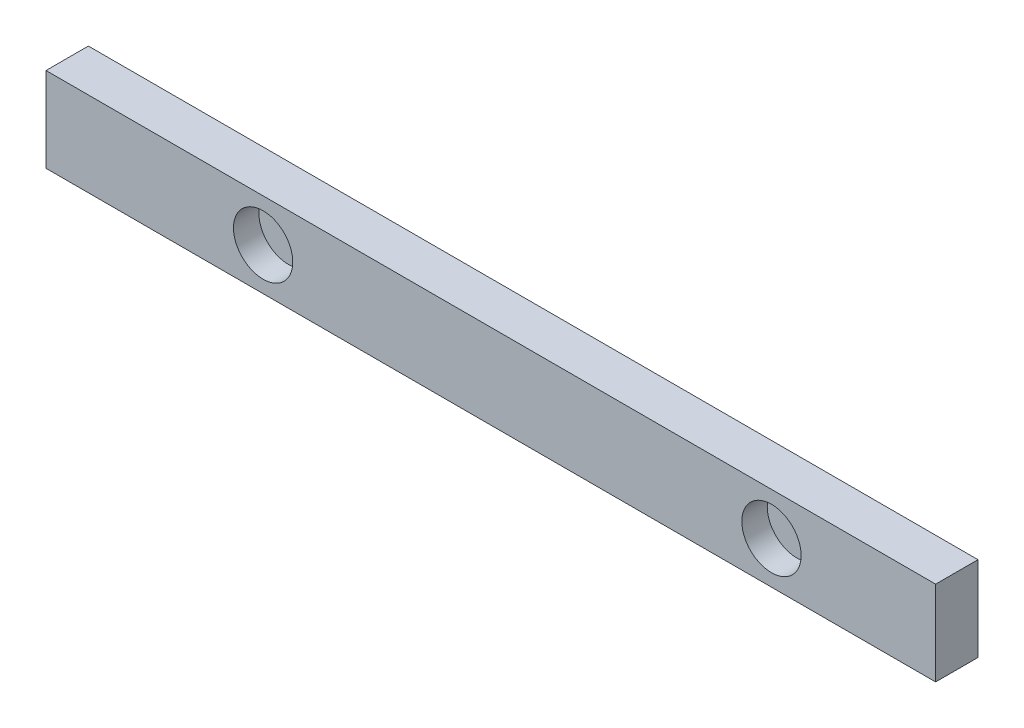
ISO-10303-21;
HEADER;
FILE_DESCRIPTION(('STEP AP214'),'2;1');
FILE_NAME('part.step','',(''),(''),'','','');
FILE_SCHEMA(('AUTOMOTIVE_DESIGN { 1 0 10303 214 1 1 1 1 }'));
ENDSEC;
DATA;
#1=APPLICATION_CONTEXT('core data for automotive mechanical design processes');
#2=APPLICATION_PROTOCOL_DEFINITION('international standard','automotive_design',2000,#1);
#3=PRODUCT_CONTEXT('',#1,'mechanical');
#4=PRODUCT('Part','Part','',(#3));
#5=PRODUCT_RELATED_PRODUCT_CATEGORY('part','',(#4));
#6=PRODUCT_DEFINITION_FORMATION('','',#4);
#7=PRODUCT_DEFINITION_CONTEXT('part definition',#1,'design');
#8=PRODUCT_DEFINITION('design','',#6,#7);
#9=PRODUCT_DEFINITION_SHAPE('','',#8);
#10=(LENGTH_UNIT() NAMED_UNIT(*) SI_UNIT(.MILLI.,.METRE.));
#11=(NAMED_UNIT(*) PLANE_ANGLE_UNIT() SI_UNIT($,.RADIAN.));
#12=(NAMED_UNIT(*) SI_UNIT($,.STERADIAN.) SOLID_ANGLE_UNIT());
#13=UNCERTAINTY_MEASURE_WITH_UNIT(LENGTH_MEASURE(1.E-05),#10,'distance_accuracy_value','');
#14=(GEOMETRIC_REPRESENTATION_CONTEXT(3) GLOBAL_UNCERTAINTY_ASSIGNED_CONTEXT((#13)) GLOBAL_UNIT_ASSIGNED_CONTEXT((#10,
#11,#12)) REPRESENTATION_CONTEXT('',''));
#15=CARTESIAN_POINT('',(0.,0.,0.));
#16=DIRECTION('',(0.,0.,1.));
#17=DIRECTION('',(1.,0.,0.));
#18=AXIS2_PLACEMENT_3D('',#15,#16,#17);
#19=CARTESIAN_POINT('',(0.,0.,25.4));
#20=DIRECTION('',(1.,0.,0.));
#21=DIRECTION('',(0.,0.,-1.));
#22=AXIS2_PLACEMENT_3D('',#19,#20,#21);
#23=PLANE('',#22);
#24=DIRECTION('',(0.,-1.,0.));
#25=VECTOR('',#24,1.);
#26=CARTESIAN_POINT('',(0.,0.,0.));
#27=LINE('',#26,#25);
#28=CARTESIAN_POINT('',(0.,50.8,0.));
#29=VERTEX_POINT('',#28);
#30=CARTESIAN_POINT('',(0.,0.,0.));
#31=VERTEX_POINT('',#30);
#32=EDGE_CURVE('E100',#29,#31,#27,.T.);
#33=ORIENTED_EDGE('',*,*,#32,.T.);
#34=DIRECTION('',(0.,0.,-1.));
#35=VECTOR('',#34,1.);
#36=CARTESIAN_POINT('',(0.,0.,25.4));
#37=LINE('',#36,#35);
#38=CARTESIAN_POINT('',(0.,0.,25.4));
#39=VERTEX_POINT('',#38);
#40=EDGE_CURVE('E11',#39,#31,#37,.T.);
#41=ORIENTED_EDGE('',*,*,#40,.F.);
#42=DIRECTION('',(0.,-1.,0.));
#43=VECTOR('',#42,1.);
#44=CARTESIAN_POINT('',(0.,0.,25.4));
#45=LINE('',#44,#43);
#46=CARTESIAN_POINT('',(0.,50.8,25.4));
#47=VERTEX_POINT('',#46);
#48=EDGE_CURVE('E87',#47,#39,#45,.T.);
#49=ORIENTED_EDGE('',*,*,#48,.F.);
#50=DIRECTION('',(0.,0.,-1.));
#51=VECTOR('',#50,1.);
#52=CARTESIAN_POINT('',(0.,50.8,25.4));
#53=LINE('',#52,#51);
#54=EDGE_CURVE('E96',#47,#29,#53,.T.);
#55=ORIENTED_EDGE('',*,*,#54,.T.);
#56=EDGE_LOOP('',(#33,#41,#49,#55));
#57=FACE_BOUND('',#56,.T.);
#58=ADVANCED_FACE('F34',(#57),#23,.F.);
#59=CARTESIAN_POINT('',(0.,0.,25.4));
#60=DIRECTION('',(0.,1.,0.));
#61=DIRECTION('',(0.,0.,1.));
#62=AXIS2_PLACEMENT_3D('',#59,#60,#61);
#63=PLANE('',#62);
#64=DIRECTION('',(1.,0.,0.));
#65=VECTOR('',#64,1.);
#66=CARTESIAN_POINT('',(0.,0.,0.));
#67=LINE('',#66,#65);
#68=CARTESIAN_POINT('',(533.4,0.,0.));
#69=VERTEX_POINT('',#68);
#70=EDGE_CURVE('E91',#31,#69,#67,.T.);
#71=ORIENTED_EDGE('',*,*,#70,.T.);
#72=DIRECTION('',(0.,0.,-1.));
#73=VECTOR('',#72,1.);
#74=CARTESIAN_POINT('',(533.4,0.,25.4));
#75=LINE('',#74,#73);
#76=CARTESIAN_POINT('',(533.4,0.,25.4));
#77=VERTEX_POINT('',#76);
#78=EDGE_CURVE('E43',#77,#69,#75,.T.);
#79=ORIENTED_EDGE('',*,*,#78,.F.);
#80=DIRECTION('',(1.,0.,0.));
#81=VECTOR('',#80,1.);
#82=CARTESIAN_POINT('',(0.,0.,25.4));
#83=LINE('',#82,#81);
#84=EDGE_CURVE('E82',#39,#77,#83,.T.);
#85=ORIENTED_EDGE('',*,*,#84,.F.);
#86=ORIENTED_EDGE('',*,*,#40,.T.);
#87=EDGE_LOOP('',(#71,#79,#85,#86));
#88=FACE_BOUND('',#87,.T.);
#89=ADVANCED_FACE('F90',(#88),#63,.F.);
#90=CARTESIAN_POINT('',(533.4,0.,25.4));
#91=DIRECTION('',(-1.,0.,0.));
#92=DIRECTION('',(0.,0.,1.));
#93=AXIS2_PLACEMENT_3D('',#90,#91,#92);
#94=PLANE('',#93);
#95=DIRECTION('',(0.,1.,0.));
#96=VECTOR('',#95,1.);
#97=CARTESIAN_POINT('',(533.4,0.,0.));
#98=LINE('',#97,#96);
#99=CARTESIAN_POINT('',(533.4,50.8,0.));
#100=VERTEX_POINT('',#99);
#101=EDGE_CURVE('E69',#69,#100,#98,.T.);
#102=ORIENTED_EDGE('',*,*,#101,.T.);
#103=DIRECTION('',(0.,0.,-1.));
#104=VECTOR('',#103,1.);
#105=CARTESIAN_POINT('',(533.4,50.8,25.4));
#106=LINE('',#105,#104);
#107=CARTESIAN_POINT('',(533.4,50.8,25.4));
#108=VERTEX_POINT('',#107);
#109=EDGE_CURVE('E92',#108,#100,#106,.T.);
#110=ORIENTED_EDGE('',*,*,#109,.F.);
#111=DIRECTION('',(0.,1.,0.));
#112=VECTOR('',#111,1.);
#113=CARTESIAN_POINT('',(533.4,0.,25.4));
#114=LINE('',#113,#112);
#115=EDGE_CURVE('E85',#77,#108,#114,.T.);
#116=ORIENTED_EDGE('',*,*,#115,.F.);
#117=ORIENTED_EDGE('',*,*,#78,.T.);
#118=EDGE_LOOP('',(#102,#110,#116,#117));
#119=FACE_BOUND('',#118,.T.);
#120=ADVANCED_FACE('F94',(#119),#94,.F.);
#121=CARTESIAN_POINT('',(0.,50.8,25.4));
#122=DIRECTION('',(0.,-1.,0.));
#123=DIRECTION('',(0.,0.,-1.));
#124=AXIS2_PLACEMENT_3D('',#121,#122,#123);
#125=PLANE('',#124);
#126=DIRECTION('',(-1.,0.,0.));
#127=VECTOR('',#126,1.);
#128=CARTESIAN_POINT('',(0.,50.8,0.));
#129=LINE('',#128,#127);
#130=EDGE_CURVE('E75',#100,#29,#129,.T.);
#131=ORIENTED_EDGE('',*,*,#130,.T.);
#132=ORIENTED_EDGE('',*,*,#54,.F.);
#133=DIRECTION('',(-1.,0.,0.));
#134=VECTOR('',#133,1.);
#135=CARTESIAN_POINT('',(0.,50.8,25.4));
#136=LINE('',#135,#134);
#137=EDGE_CURVE('E52',#108,#47,#136,.T.);
#138=ORIENTED_EDGE('',*,*,#137,.F.);
#139=ORIENTED_EDGE('',*,*,#109,.T.);
#140=EDGE_LOOP('',(#131,#132,#138,#139));
#141=FACE_BOUND('',#140,.T.);
#142=ADVANCED_FACE('F201',(#141),#125,.F.);
#143=CARTESIAN_POINT('',(0.,0.,25.4));
#144=DIRECTION('',(0.,0.,-1.));
#145=DIRECTION('',(-1.,0.,0.));
#146=AXIS2_PLACEMENT_3D('',#143,#144,#145);
#147=PLANE('',#146);
#148=CARTESIAN_POINT('',(130.175,25.2907213080391,25.4));
#149=DIRECTION('',(0.,0.,-1.));
#150=DIRECTION('',(-1.,0.,0.));
#151=AXIS2_PLACEMENT_3D('',#148,#149,#150);
#152=CIRCLE('',#151,17.78);
#153=CARTESIAN_POINT('',(112.395,25.2907213080391,25.4));
#154=VERTEX_POINT('',#153);
#155=EDGE_CURVE('E37',#154,#154,#152,.T.);
#156=ORIENTED_EDGE('',*,*,#155,.T.);
#157=EDGE_LOOP('',(#156));
#158=FACE_BOUND('',#157,.T.);
#159=CARTESIAN_POINT('',(434.975,25.2907213080391,25.4));
#160=DIRECTION('',(0.,0.,-1.));
#161=DIRECTION('',(-1.,0.,0.));
#162=AXIS2_PLACEMENT_3D('',#159,#160,#161);
#163=CIRCLE('',#162,17.78);
#164=CARTESIAN_POINT('',(417.195,25.2907213080391,25.4));
#165=VERTEX_POINT('',#164);
#166=EDGE_CURVE('E107',#165,#165,#163,.T.);
#167=ORIENTED_EDGE('',*,*,#166,.T.);
#168=EDGE_LOOP('',(#167));
#169=FACE_BOUND('',#168,.T.);
#170=ORIENTED_EDGE('',*,*,#48,.T.);
#171=ORIENTED_EDGE('',*,*,#84,.T.);
#172=ORIENTED_EDGE('',*,*,#115,.T.);
#173=ORIENTED_EDGE('',*,*,#137,.T.);
#174=EDGE_LOOP('',(#170,#171,#172,#173));
#175=FACE_BOUND('',#174,.T.);
#176=ADVANCED_FACE('F83',(#158,#169,#175),#147,.F.);
#177=CARTESIAN_POINT('',(0.,0.,0.));
#178=DIRECTION('',(0.,0.,-1.));
#179=DIRECTION('',(-1.,0.,0.));
#180=AXIS2_PLACEMENT_3D('',#177,#178,#179);
#181=PLANE('',#180);
#182=CARTESIAN_POINT('',(122.728486168932,18.9092553185146,0.));
#183=DIRECTION('',(0.,0.,-1.));
#184=DIRECTION('',(-1.,0.,0.));
#185=AXIS2_PLACEMENT_3D('',#182,#183,#184);
#186=CIRCLE('',#185,2.4638);
#187=CARTESIAN_POINT('',(120.264686168932,18.9092553185146,0.));
#188=VERTEX_POINT('',#187);
#189=EDGE_CURVE('E171',#188,#188,#186,.T.);
#190=ORIENTED_EDGE('',*,*,#189,.F.);
#191=EDGE_LOOP('',(#190));
#192=FACE_BOUND('',#191,.T.);
#193=CARTESIAN_POINT('',(122.728486168932,31.8907446814854,0.));
#194=DIRECTION('',(0.,0.,-1.));
#195=DIRECTION('',(-1.,0.,0.));
#196=AXIS2_PLACEMENT_3D('',#193,#194,#195);
#197=CIRCLE('',#196,2.4638);
#198=CARTESIAN_POINT('',(120.264686168932,31.8907446814854,0.));
#199=VERTEX_POINT('',#198);
#200=EDGE_CURVE('E165',#199,#199,#197,.T.);
#201=ORIENTED_EDGE('',*,*,#200,.F.);
#202=EDGE_LOOP('',(#201));
#203=FACE_BOUND('',#202,.T.);
#204=CARTESIAN_POINT('',(137.621513831068,18.9092553185146,0.));
#205=DIRECTION('',(0.,0.,-1.));
#206=DIRECTION('',(-1.,0.,0.));
#207=AXIS2_PLACEMENT_3D('',#204,#205,#206);
#208=CIRCLE('',#207,2.4638);
#209=CARTESIAN_POINT('',(135.157713831068,18.9092553185146,0.));
#210=VERTEX_POINT('',#209);
#211=EDGE_CURVE('E159',#210,#210,#208,.T.);
#212=ORIENTED_EDGE('',*,*,#211,.F.);
#213=EDGE_LOOP('',(#212));
#214=FACE_BOUND('',#213,.T.);
#215=CARTESIAN_POINT('',(137.621513831068,31.8907446814854,0.));
#216=DIRECTION('',(0.,0.,-1.));
#217=DIRECTION('',(-1.,0.,0.));
#218=AXIS2_PLACEMENT_3D('',#215,#216,#217);
#219=CIRCLE('',#218,2.4638);
#220=CARTESIAN_POINT('',(135.157713831068,31.8907446814854,0.));
#221=VERTEX_POINT('',#220);
#222=EDGE_CURVE('E135',#221,#221,#219,.T.);
#223=ORIENTED_EDGE('',*,*,#222,.F.);
#224=EDGE_LOOP('',(#223));
#225=FACE_BOUND('',#224,.T.);
#226=CARTESIAN_POINT('',(442.421513831068,18.9092553185146,0.));
#227=DIRECTION('',(0.,0.,-1.));
#228=DIRECTION('',(-1.,0.,0.));
#229=AXIS2_PLACEMENT_3D('',#226,#227,#228);
#230=CIRCLE('',#229,2.4638);
#231=CARTESIAN_POINT('',(439.957713831068,18.9092553185146,0.));
#232=VERTEX_POINT('',#231);
#233=EDGE_CURVE('E142',#232,#232,#230,.T.);
#234=ORIENTED_EDGE('',*,*,#233,.F.);
#235=EDGE_LOOP('',(#234));
#236=FACE_BOUND('',#235,.T.);
#237=CARTESIAN_POINT('',(427.528486168932,31.8907446814854,0.));
#238=DIRECTION('',(0.,0.,-1.));
#239=DIRECTION('',(-1.,0.,0.));
#240=AXIS2_PLACEMENT_3D('',#237,#238,#239);
#241=CIRCLE('',#240,2.4638);
#242=CARTESIAN_POINT('',(425.064686168932,31.8907446814854,0.));
#243=VERTEX_POINT('',#242);
#244=EDGE_CURVE('E149',#243,#243,#241,.T.);
#245=ORIENTED_EDGE('',*,*,#244,.F.);
#246=EDGE_LOOP('',(#245));
#247=FACE_BOUND('',#246,.T.);
#248=CARTESIAN_POINT('',(434.975,25.4,0.));
#249=DIRECTION('',(0.,0.,-1.));
#250=DIRECTION('',(-1.,0.,0.));
#251=AXIS2_PLACEMENT_3D('',#248,#249,#250);
#252=CIRCLE('',#251,6.01979999999996);
#253=CARTESIAN_POINT('',(428.9552,25.4,0.));
#254=VERTEX_POINT('',#253);
#255=EDGE_CURVE('E128',#254,#254,#252,.T.);
#256=ORIENTED_EDGE('',*,*,#255,.F.);
#257=EDGE_LOOP('',(#256));
#258=FACE_BOUND('',#257,.T.);
#259=CARTESIAN_POINT('',(427.528486168932,18.9092553185146,0.));
#260=DIRECTION('',(0.,0.,-1.));
#261=DIRECTION('',(-1.,0.,0.));
#262=AXIS2_PLACEMENT_3D('',#259,#260,#261);
#263=CIRCLE('',#262,2.4638);
#264=CARTESIAN_POINT('',(425.064686168932,18.9092553185146,0.));
#265=VERTEX_POINT('',#264);
#266=EDGE_CURVE('E136',#265,#265,#263,.T.);
#267=ORIENTED_EDGE('',*,*,#266,.F.);
#268=EDGE_LOOP('',(#267));
#269=FACE_BOUND('',#268,.T.);
#270=CARTESIAN_POINT('',(442.421513831068,31.8907446814854,0.));
#271=DIRECTION('',(0.,0.,-1.));
#272=DIRECTION('',(-1.,0.,0.));
#273=AXIS2_PLACEMENT_3D('',#270,#271,#272);
#274=CIRCLE('',#273,2.4638);
#275=CARTESIAN_POINT('',(439.957713831068,31.8907446814854,0.));
#276=VERTEX_POINT('',#275);
#277=EDGE_CURVE('E176',#276,#276,#274,.T.);
#278=ORIENTED_EDGE('',*,*,#277,.F.);
#279=EDGE_LOOP('',(#278));
#280=FACE_BOUND('',#279,.T.);
#281=CARTESIAN_POINT('',(130.175,25.4,0.));
#282=DIRECTION('',(0.,0.,-1.));
#283=DIRECTION('',(-1.,0.,0.));
#284=AXIS2_PLACEMENT_3D('',#281,#282,#283);
#285=CIRCLE('',#284,6.0198);
#286=CARTESIAN_POINT('',(124.1552,25.4,0.));
#287=VERTEX_POINT('',#286);
#288=EDGE_CURVE('E122',#287,#287,#285,.T.);
#289=ORIENTED_EDGE('',*,*,#288,.F.);
#290=EDGE_LOOP('',(#289));
#291=FACE_BOUND('',#290,.T.);
#292=ORIENTED_EDGE('',*,*,#32,.F.);
#293=ORIENTED_EDGE('',*,*,#130,.F.);
#294=ORIENTED_EDGE('',*,*,#101,.F.);
#295=ORIENTED_EDGE('',*,*,#70,.F.);
#296=EDGE_LOOP('',(#292,#293,#294,#295));
#297=FACE_BOUND('',#296,.T.);
#298=ADVANCED_FACE('F191',(#192,#203,#214,#225,#236,#247,#258,#269,#280,#291,#297),#181,.T.);
#299=CARTESIAN_POINT('',(434.975,25.2907213080391,137.16));
#300=DIRECTION('',(0.,0.,-1.));
#301=DIRECTION('',(-1.,0.,0.));
#302=AXIS2_PLACEMENT_3D('',#299,#300,#301);
#303=CYLINDRICAL_SURFACE('',#302,17.78);
#304=CARTESIAN_POINT('',(434.975,25.2907213080391,10.16));
#305=DIRECTION('',(0.,0.,-1.));
#306=DIRECTION('',(-1.,0.,0.));
#307=AXIS2_PLACEMENT_3D('',#304,#305,#306);
#308=CIRCLE('',#307,17.78);
#309=CARTESIAN_POINT('',(417.195,25.2907213080391,10.16));
#310=VERTEX_POINT('',#309);
#311=EDGE_CURVE('E114',#310,#310,#308,.T.);
#312=ORIENTED_EDGE('',*,*,#311,.T.);
#313=EDGE_LOOP('',(#312));
#314=FACE_BOUND('',#313,.T.);
#315=ORIENTED_EDGE('',*,*,#166,.F.);
#316=EDGE_LOOP('',(#315));
#317=FACE_BOUND('',#316,.T.);
#318=ADVANCED_FACE('F194',(#314,#317),#303,.F.);
#319=CARTESIAN_POINT('',(434.975,25.2907213080391,10.16));
#320=DIRECTION('',(0.,0.,-1.));
#321=DIRECTION('',(-1.,0.,0.));
#322=AXIS2_PLACEMENT_3D('',#319,#320,#321);
#323=PLANE('',#322);
#324=ORIENTED_EDGE('',*,*,#311,.F.);
#325=EDGE_LOOP('',(#324));
#326=FACE_BOUND('',#325,.T.);
#327=ADVANCED_FACE('F239',(#326),#323,.F.);
#328=CARTESIAN_POINT('',(130.175,25.2907213080391,137.16));
#329=DIRECTION('',(0.,0.,-1.));
#330=DIRECTION('',(-1.,0.,0.));
#331=AXIS2_PLACEMENT_3D('',#328,#329,#330);
#332=CYLINDRICAL_SURFACE('',#331,17.78);
#333=CARTESIAN_POINT('',(130.175,25.2907213080391,10.16));
#334=DIRECTION('',(0.,0.,-1.));
#335=DIRECTION('',(-1.,0.,0.));
#336=AXIS2_PLACEMENT_3D('',#333,#334,#335);
#337=CIRCLE('',#336,17.78);
#338=CARTESIAN_POINT('',(112.395,25.2907213080391,10.16));
#339=VERTEX_POINT('',#338);
#340=EDGE_CURVE('E109',#339,#339,#337,.T.);
#341=ORIENTED_EDGE('',*,*,#340,.T.);
#342=EDGE_LOOP('',(#341));
#343=FACE_BOUND('',#342,.T.);
#344=ORIENTED_EDGE('',*,*,#155,.F.);
#345=EDGE_LOOP('',(#344));
#346=FACE_BOUND('',#345,.T.);
#347=ADVANCED_FACE('F250',(#343,#346),#332,.F.);
#348=CARTESIAN_POINT('',(130.175,25.2907213080391,10.16));
#349=DIRECTION('',(0.,0.,-1.));
#350=DIRECTION('',(-1.,0.,0.));
#351=AXIS2_PLACEMENT_3D('',#348,#349,#350);
#352=PLANE('',#351);
#353=ORIENTED_EDGE('',*,*,#340,.F.);
#354=EDGE_LOOP('',(#353));
#355=FACE_BOUND('',#354,.T.);
#356=ADVANCED_FACE('F260',(#355),#352,.F.);
#357=CARTESIAN_POINT('',(130.175,25.4,7.62));
#358=DIRECTION('',(0.,0.,-1.));
#359=DIRECTION('',(-1.,0.,0.));
#360=AXIS2_PLACEMENT_3D('',#357,#358,#359);
#361=CYLINDRICAL_SURFACE('',#360,6.0198);
#362=CARTESIAN_POINT('',(130.175,25.4,7.62));
#363=DIRECTION('',(0.,0.,-1.));
#364=DIRECTION('',(-1.,0.,0.));
#365=AXIS2_PLACEMENT_3D('',#362,#363,#364);
#366=CIRCLE('',#365,6.0198);
#367=CARTESIAN_POINT('',(124.1552,25.4,7.62));
#368=VERTEX_POINT('',#367);
#369=EDGE_CURVE('E119',#368,#368,#366,.T.);
#370=ORIENTED_EDGE('',*,*,#369,.F.);
#371=EDGE_LOOP('',(#370));
#372=FACE_BOUND('',#371,.T.);
#373=ORIENTED_EDGE('',*,*,#288,.T.);
#374=EDGE_LOOP('',(#373));
#375=FACE_BOUND('',#374,.T.);
#376=ADVANCED_FACE('F268',(#372,#375),#361,.F.);
#377=CARTESIAN_POINT('',(130.175,25.4,7.62));
#378=DIRECTION('',(0.,0.,-1.));
#379=DIRECTION('',(-1.,0.,0.));
#380=AXIS2_PLACEMENT_3D('',#377,#378,#379);
#381=PLANE('',#380);
#382=ORIENTED_EDGE('',*,*,#369,.T.);
#383=EDGE_LOOP('',(#382));
#384=FACE_BOUND('',#383,.T.);
#385=ADVANCED_FACE('F187',(#384),#381,.T.);
#386=CARTESIAN_POINT('',(442.421513831068,31.8907446814854,7.62));
#387=DIRECTION('',(0.,0.,-1.));
#388=DIRECTION('',(-1.,0.,0.));
#389=AXIS2_PLACEMENT_3D('',#386,#387,#388);
#390=CYLINDRICAL_SURFACE('',#389,2.4638);
#391=CARTESIAN_POINT('',(442.421513831068,31.8907446814854,7.62));
#392=DIRECTION('',(0.,0.,-1.));
#393=DIRECTION('',(-1.,0.,0.));
#394=AXIS2_PLACEMENT_3D('',#391,#392,#393);
#395=CIRCLE('',#394,2.4638);
#396=CARTESIAN_POINT('',(439.957713831068,31.8907446814854,7.62));
#397=VERTEX_POINT('',#396);
#398=EDGE_CURVE('E146',#397,#397,#395,.T.);
#399=ORIENTED_EDGE('',*,*,#398,.F.);
#400=EDGE_LOOP('',(#399));
#401=FACE_BOUND('',#400,.T.);
#402=ORIENTED_EDGE('',*,*,#277,.T.);
#403=EDGE_LOOP('',(#402));
#404=FACE_BOUND('',#403,.T.);
#405=ADVANCED_FACE('F184',(#401,#404),#390,.F.);
#406=CARTESIAN_POINT('',(442.421513831068,31.8907446814854,7.62));
#407=DIRECTION('',(0.,0.,-1.));
#408=DIRECTION('',(-1.,0.,0.));
#409=AXIS2_PLACEMENT_3D('',#406,#407,#408);
#410=PLANE('',#409);
#411=ORIENTED_EDGE('',*,*,#398,.T.);
#412=EDGE_LOOP('',(#411));
#413=FACE_BOUND('',#412,.T.);
#414=ADVANCED_FACE('F182',(#413),#410,.T.);
#415=CARTESIAN_POINT('',(427.528486168932,18.9092553185146,7.62));
#416=DIRECTION('',(0.,0.,-1.));
#417=DIRECTION('',(-1.,0.,0.));
#418=AXIS2_PLACEMENT_3D('',#415,#416,#417);
#419=CYLINDRICAL_SURFACE('',#418,2.4638);
#420=CARTESIAN_POINT('',(427.528486168932,18.9092553185146,7.62));
#421=DIRECTION('',(0.,0.,-1.));
#422=DIRECTION('',(-1.,0.,0.));
#423=AXIS2_PLACEMENT_3D('',#420,#421,#422);
#424=CIRCLE('',#423,2.4638);
#425=CARTESIAN_POINT('',(425.064686168932,18.9092553185146,7.62));
#426=VERTEX_POINT('',#425);
#427=EDGE_CURVE('E132',#426,#426,#424,.T.);
#428=ORIENTED_EDGE('',*,*,#427,.F.);
#429=EDGE_LOOP('',(#428));
#430=FACE_BOUND('',#429,.T.);
#431=ORIENTED_EDGE('',*,*,#266,.T.);
#432=EDGE_LOOP('',(#431));
#433=FACE_BOUND('',#432,.T.);
#434=ADVANCED_FACE('F305',(#430,#433),#419,.F.);
#435=CARTESIAN_POINT('',(427.528486168932,18.9092553185146,7.62));
#436=DIRECTION('',(0.,0.,-1.));
#437=DIRECTION('',(-1.,0.,0.));
#438=AXIS2_PLACEMENT_3D('',#435,#436,#437);
#439=PLANE('',#438);
#440=ORIENTED_EDGE('',*,*,#427,.T.);
#441=EDGE_LOOP('',(#440));
#442=FACE_BOUND('',#441,.T.);
#443=ADVANCED_FACE('F314',(#442),#439,.T.);
#444=CARTESIAN_POINT('',(434.975,25.4,7.62));
#445=DIRECTION('',(0.,0.,-1.));
#446=DIRECTION('',(-1.,0.,0.));
#447=AXIS2_PLACEMENT_3D('',#444,#445,#446);
#448=CYLINDRICAL_SURFACE('',#447,6.01979999999996);
#449=CARTESIAN_POINT('',(434.975,25.4,7.62));
#450=DIRECTION('',(0.,0.,-1.));
#451=DIRECTION('',(-1.,0.,0.));
#452=AXIS2_PLACEMENT_3D('',#449,#450,#451);
#453=CIRCLE('',#452,6.01979999999996);
#454=CARTESIAN_POINT('',(428.9552,25.4,7.62));
#455=VERTEX_POINT('',#454);
#456=EDGE_CURVE('E131',#455,#455,#453,.T.);
#457=ORIENTED_EDGE('',*,*,#456,.F.);
#458=EDGE_LOOP('',(#457));
#459=FACE_BOUND('',#458,.T.);
#460=ORIENTED_EDGE('',*,*,#255,.T.);
#461=EDGE_LOOP('',(#460));
#462=FACE_BOUND('',#461,.T.);
#463=ADVANCED_FACE('F324',(#459,#462),#448,.F.);
#464=CARTESIAN_POINT('',(434.975,25.4,7.62));
#465=DIRECTION('',(0.,0.,-1.));
#466=DIRECTION('',(-1.,0.,0.));
#467=AXIS2_PLACEMENT_3D('',#464,#465,#466);
#468=PLANE('',#467);
#469=ORIENTED_EDGE('',*,*,#456,.T.);
#470=EDGE_LOOP('',(#469));
#471=FACE_BOUND('',#470,.T.);
#472=ADVANCED_FACE('F334',(#471),#468,.T.);
#473=CARTESIAN_POINT('',(427.528486168932,31.8907446814854,7.62));
#474=DIRECTION('',(0.,0.,-1.));
#475=DIRECTION('',(-1.,0.,0.));
#476=AXIS2_PLACEMENT_3D('',#473,#474,#475);
#477=CYLINDRICAL_SURFACE('',#476,2.4638);
#478=CARTESIAN_POINT('',(427.528486168932,31.8907446814854,7.62));
#479=DIRECTION('',(0.,0.,-1.));
#480=DIRECTION('',(-1.,0.,0.));
#481=AXIS2_PLACEMENT_3D('',#478,#479,#480);
#482=CIRCLE('',#481,2.4638);
#483=CARTESIAN_POINT('',(425.064686168932,31.8907446814854,7.62));
#484=VERTEX_POINT('',#483);
#485=EDGE_CURVE('E139',#484,#484,#482,.T.);
#486=ORIENTED_EDGE('',*,*,#485,.F.);
#487=EDGE_LOOP('',(#486));
#488=FACE_BOUND('',#487,.T.);
#489=ORIENTED_EDGE('',*,*,#244,.T.);
#490=EDGE_LOOP('',(#489));
#491=FACE_BOUND('',#490,.T.);
#492=ADVANCED_FACE('F344',(#488,#491),#477,.F.);
#493=CARTESIAN_POINT('',(427.528486168932,31.8907446814854,7.62));
#494=DIRECTION('',(0.,0.,-1.));
#495=DIRECTION('',(-1.,0.,0.));
#496=AXIS2_PLACEMENT_3D('',#493,#494,#495);
#497=PLANE('',#496);
#498=ORIENTED_EDGE('',*,*,#485,.T.);
#499=EDGE_LOOP('',(#498));
#500=FACE_BOUND('',#499,.T.);
#501=ADVANCED_FACE('F354',(#500),#497,.T.);
#502=CARTESIAN_POINT('',(442.421513831068,18.9092553185146,7.62));
#503=DIRECTION('',(0.,0.,-1.));
#504=DIRECTION('',(-1.,0.,0.));
#505=AXIS2_PLACEMENT_3D('',#502,#503,#504);
#506=CYLINDRICAL_SURFACE('',#505,2.4638);
#507=CARTESIAN_POINT('',(442.421513831068,18.9092553185146,7.62));
#508=DIRECTION('',(0.,0.,-1.));
#509=DIRECTION('',(-1.,0.,0.));
#510=AXIS2_PLACEMENT_3D('',#507,#508,#509);
#511=CIRCLE('',#510,2.4638);
#512=CARTESIAN_POINT('',(439.957713831068,18.9092553185146,7.62));
#513=VERTEX_POINT('',#512);
#514=EDGE_CURVE('E145',#513,#513,#511,.T.);
#515=ORIENTED_EDGE('',*,*,#514,.F.);
#516=EDGE_LOOP('',(#515));
#517=FACE_BOUND('',#516,.T.);
#518=ORIENTED_EDGE('',*,*,#233,.T.);
#519=EDGE_LOOP('',(#518));
#520=FACE_BOUND('',#519,.T.);
#521=ADVANCED_FACE('F364',(#517,#520),#506,.F.);
#522=CARTESIAN_POINT('',(442.421513831068,18.9092553185146,7.62));
#523=DIRECTION('',(0.,0.,-1.));
#524=DIRECTION('',(-1.,0.,0.));
#525=AXIS2_PLACEMENT_3D('',#522,#523,#524);
#526=PLANE('',#525);
#527=ORIENTED_EDGE('',*,*,#514,.T.);
#528=EDGE_LOOP('',(#527));
#529=FACE_BOUND('',#528,.T.);
#530=ADVANCED_FACE('F374',(#529),#526,.T.);
#531=CARTESIAN_POINT('',(137.621513831068,31.8907446814854,7.62));
#532=DIRECTION('',(0.,0.,-1.));
#533=DIRECTION('',(-1.,0.,0.));
#534=AXIS2_PLACEMENT_3D('',#531,#532,#533);
#535=CYLINDRICAL_SURFACE('',#534,2.4638);
#536=CARTESIAN_POINT('',(137.621513831068,31.8907446814854,7.62));
#537=DIRECTION('',(0.,0.,-1.));
#538=DIRECTION('',(-1.,0.,0.));
#539=AXIS2_PLACEMENT_3D('',#536,#537,#538);
#540=CIRCLE('',#539,2.4638);
#541=CARTESIAN_POINT('',(135.157713831068,31.8907446814854,7.62));
#542=VERTEX_POINT('',#541);
#543=EDGE_CURVE('E156',#542,#542,#540,.T.);
#544=ORIENTED_EDGE('',*,*,#543,.F.);
#545=EDGE_LOOP('',(#544));
#546=FACE_BOUND('',#545,.T.);
#547=ORIENTED_EDGE('',*,*,#222,.T.);
#548=EDGE_LOOP('',(#547));
#549=FACE_BOUND('',#548,.T.);
#550=ADVANCED_FACE('F384',(#546,#549),#535,.F.);
#551=CARTESIAN_POINT('',(137.621513831068,31.8907446814854,7.62));
#552=DIRECTION('',(0.,0.,-1.));
#553=DIRECTION('',(-1.,0.,0.));
#554=AXIS2_PLACEMENT_3D('',#551,#552,#553);
#555=PLANE('',#554);
#556=ORIENTED_EDGE('',*,*,#543,.T.);
#557=EDGE_LOOP('',(#556));
#558=FACE_BOUND('',#557,.T.);
#559=ADVANCED_FACE('F394',(#558),#555,.T.);
#560=CARTESIAN_POINT('',(137.621513831068,18.9092553185146,7.62));
#561=DIRECTION('',(0.,0.,-1.));
#562=DIRECTION('',(-1.,0.,0.));
#563=AXIS2_PLACEMENT_3D('',#560,#561,#562);
#564=CYLINDRICAL_SURFACE('',#563,2.4638);
#565=CARTESIAN_POINT('',(137.621513831068,18.9092553185146,7.62));
#566=DIRECTION('',(0.,0.,-1.));
#567=DIRECTION('',(-1.,0.,0.));
#568=AXIS2_PLACEMENT_3D('',#565,#566,#567);
#569=CIRCLE('',#568,2.4638);
#570=CARTESIAN_POINT('',(135.157713831068,18.9092553185146,7.62));
#571=VERTEX_POINT('',#570);
#572=EDGE_CURVE('E162',#571,#571,#569,.T.);
#573=ORIENTED_EDGE('',*,*,#572,.F.);
#574=EDGE_LOOP('',(#573));
#575=FACE_BOUND('',#574,.T.);
#576=ORIENTED_EDGE('',*,*,#211,.T.);
#577=EDGE_LOOP('',(#576));
#578=FACE_BOUND('',#577,.T.);
#579=ADVANCED_FACE('F404',(#575,#578),#564,.F.);
#580=CARTESIAN_POINT('',(137.621513831068,18.9092553185146,7.62));
#581=DIRECTION('',(0.,0.,-1.));
#582=DIRECTION('',(-1.,0.,0.));
#583=AXIS2_PLACEMENT_3D('',#580,#581,#582);
#584=PLANE('',#583);
#585=ORIENTED_EDGE('',*,*,#572,.T.);
#586=EDGE_LOOP('',(#585));
#587=FACE_BOUND('',#586,.T.);
#588=ADVANCED_FACE('F414',(#587),#584,.T.);
#589=CARTESIAN_POINT('',(122.728486168932,31.8907446814854,7.62));
#590=DIRECTION('',(0.,0.,-1.));
#591=DIRECTION('',(-1.,0.,0.));
#592=AXIS2_PLACEMENT_3D('',#589,#590,#591);
#593=CYLINDRICAL_SURFACE('',#592,2.4638);
#594=CARTESIAN_POINT('',(122.728486168932,31.8907446814854,7.62));
#595=DIRECTION('',(0.,0.,-1.));
#596=DIRECTION('',(-1.,0.,0.));
#597=AXIS2_PLACEMENT_3D('',#594,#595,#596);
#598=CIRCLE('',#597,2.4638);
#599=CARTESIAN_POINT('',(120.264686168932,31.8907446814854,7.62));
#600=VERTEX_POINT('',#599);
#601=EDGE_CURVE('E168',#600,#600,#598,.T.);
#602=ORIENTED_EDGE('',*,*,#601,.F.);
#603=EDGE_LOOP('',(#602));
#604=FACE_BOUND('',#603,.T.);
#605=ORIENTED_EDGE('',*,*,#200,.T.);
#606=EDGE_LOOP('',(#605));
#607=FACE_BOUND('',#606,.T.);
#608=ADVANCED_FACE('F424',(#604,#607),#593,.F.);
#609=CARTESIAN_POINT('',(122.728486168932,31.8907446814854,7.62));
#610=DIRECTION('',(0.,0.,-1.));
#611=DIRECTION('',(-1.,0.,0.));
#612=AXIS2_PLACEMENT_3D('',#609,#610,#611);
#613=PLANE('',#612);
#614=ORIENTED_EDGE('',*,*,#601,.T.);
#615=EDGE_LOOP('',(#614));
#616=FACE_BOUND('',#615,.T.);
#617=ADVANCED_FACE('F434',(#616),#613,.T.);
#618=CARTESIAN_POINT('',(122.728486168932,18.9092553185146,7.62));
#619=DIRECTION('',(0.,0.,-1.));
#620=DIRECTION('',(-1.,0.,0.));
#621=AXIS2_PLACEMENT_3D('',#618,#619,#620);
#622=CYLINDRICAL_SURFACE('',#621,2.4638);
#623=CARTESIAN_POINT('',(122.728486168932,18.9092553185146,7.62));
#624=DIRECTION('',(0.,0.,-1.));
#625=DIRECTION('',(-1.,0.,0.));
#626=AXIS2_PLACEMENT_3D('',#623,#624,#625);
#627=CIRCLE('',#626,2.4638);
#628=CARTESIAN_POINT('',(120.264686168932,18.9092553185146,7.62));
#629=VERTEX_POINT('',#628);
#630=EDGE_CURVE('E125',#629,#629,#627,.T.);
#631=ORIENTED_EDGE('',*,*,#630,.F.);
#632=EDGE_LOOP('',(#631));
#633=FACE_BOUND('',#632,.T.);
#634=ORIENTED_EDGE('',*,*,#189,.T.);
#635=EDGE_LOOP('',(#634));
#636=FACE_BOUND('',#635,.T.);
#637=ADVANCED_FACE('F444',(#633,#636),#622,.F.);
#638=CARTESIAN_POINT('',(122.728486168932,18.9092553185146,7.62));
#639=DIRECTION('',(0.,0.,-1.));
#640=DIRECTION('',(-1.,0.,0.));
#641=AXIS2_PLACEMENT_3D('',#638,#639,#640);
#642=PLANE('',#641);
#643=ORIENTED_EDGE('',*,*,#630,.T.);
#644=EDGE_LOOP('',(#643));
#645=FACE_BOUND('',#644,.T.);
#646=ADVANCED_FACE('F454',(#645),#642,.T.);
#647=CLOSED_SHELL('',(#58,#89,#120,#142,#176,#298,#318,#327,#347,#356,#376,#385,#405,#414,#434,
#443,#463,#472,#492,#501,#521,#530,#550,#559,#579,#588,#608,#617,#637,#646));
#648=MANIFOLD_SOLID_BREP('B2',#647);
#649=ADVANCED_BREP_SHAPE_REPRESENTATION('',(#18,#648),#14);
#650=SHAPE_DEFINITION_REPRESENTATION(#9,#649);
ENDSEC;
END-ISO-10303-21;
